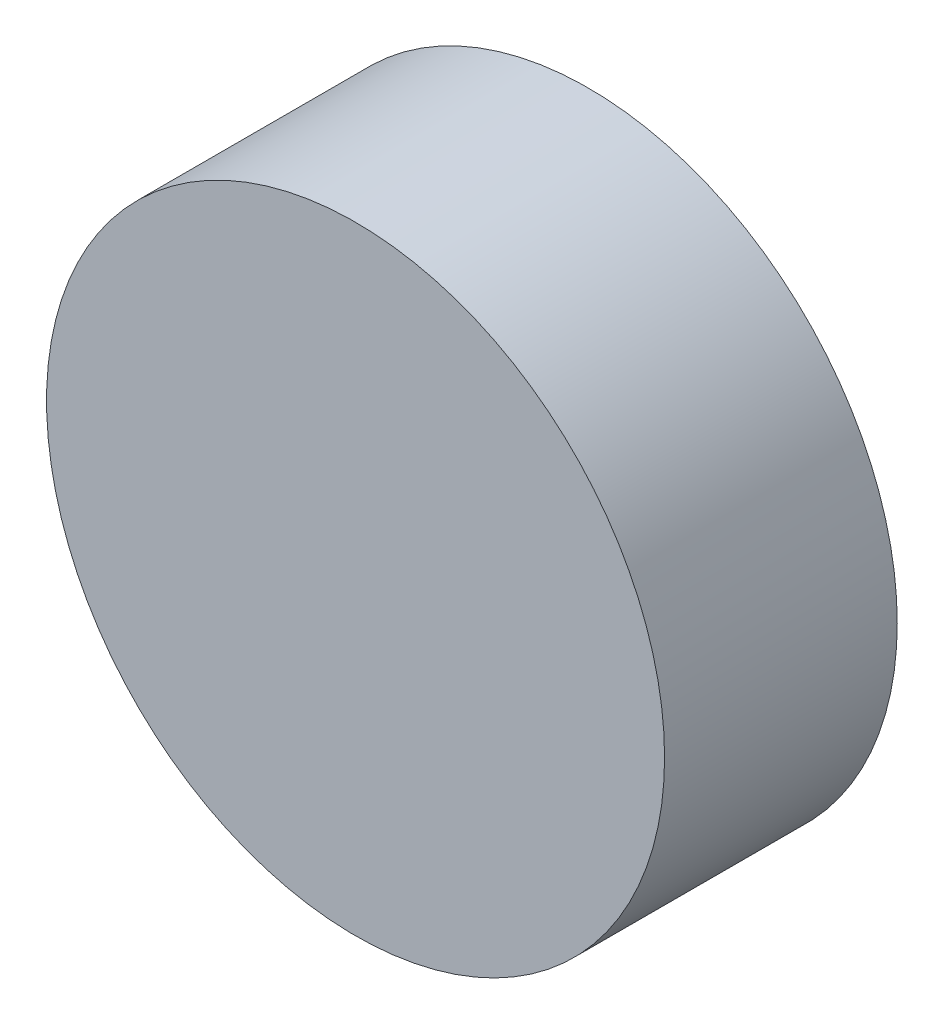
ISO-10303-21;
HEADER;
FILE_DESCRIPTION(('STEP AP214'),'2;1');
FILE_NAME('part.step','',(''),(''),'','','');
FILE_SCHEMA(('AUTOMOTIVE_DESIGN { 1 0 10303 214 1 1 1 1 }'));
ENDSEC;
DATA;
#1=APPLICATION_CONTEXT('core data for automotive mechanical design processes');
#2=APPLICATION_PROTOCOL_DEFINITION('international standard','automotive_design',2000,#1);
#3=PRODUCT_CONTEXT('',#1,'mechanical');
#4=PRODUCT('Part','Part','',(#3));
#5=PRODUCT_RELATED_PRODUCT_CATEGORY('part','',(#4));
#6=PRODUCT_DEFINITION_FORMATION('','',#4);
#7=PRODUCT_DEFINITION_CONTEXT('part definition',#1,'design');
#8=PRODUCT_DEFINITION('design','',#6,#7);
#9=PRODUCT_DEFINITION_SHAPE('','',#8);
#10=(LENGTH_UNIT() NAMED_UNIT(*) SI_UNIT(.MILLI.,.METRE.));
#11=(NAMED_UNIT(*) PLANE_ANGLE_UNIT() SI_UNIT($,.RADIAN.));
#12=(NAMED_UNIT(*) SI_UNIT($,.STERADIAN.) SOLID_ANGLE_UNIT());
#13=UNCERTAINTY_MEASURE_WITH_UNIT(LENGTH_MEASURE(1.E-05),#10,'distance_accuracy_value','');
#14=(GEOMETRIC_REPRESENTATION_CONTEXT(3) GLOBAL_UNCERTAINTY_ASSIGNED_CONTEXT((#13)) GLOBAL_UNIT_ASSIGNED_CONTEXT((#10,
#11,#12)) REPRESENTATION_CONTEXT('',''));
#15=CARTESIAN_POINT('',(0.,0.,0.));
#16=DIRECTION('',(0.,0.,1.));
#17=DIRECTION('',(1.,0.,0.));
#18=AXIS2_PLACEMENT_3D('',#15,#16,#17);
#19=CARTESIAN_POINT('',(0.,0.,32.));
#20=DIRECTION('',(0.,0.,-1.));
#21=DIRECTION('',(-1.,0.,0.));
#22=AXIS2_PLACEMENT_3D('',#19,#20,#21);
#23=CYLINDRICAL_SURFACE('',#22,42.5);
#24=CARTESIAN_POINT('',(0.,0.,32.));
#25=DIRECTION('',(0.,0.,1.));
#26=DIRECTION('',(1.,0.,0.));
#27=AXIS2_PLACEMENT_3D('',#24,#25,#26);
#28=CIRCLE('',#27,42.5);
#29=CARTESIAN_POINT('',(42.5,0.,32.));
#30=VERTEX_POINT('',#29);
#31=EDGE_CURVE('E10',#30,#30,#28,.T.);
#32=ORIENTED_EDGE('',*,*,#31,.F.);
#33=EDGE_LOOP('',(#32));
#34=FACE_BOUND('',#33,.T.);
#35=CARTESIAN_POINT('',(0.,0.,0.));
#36=DIRECTION('',(0.,0.,1.));
#37=DIRECTION('',(1.,0.,0.));
#38=AXIS2_PLACEMENT_3D('',#35,#36,#37);
#39=CIRCLE('',#38,42.5);
#40=CARTESIAN_POINT('',(42.5,0.,0.));
#41=VERTEX_POINT('',#40);
#42=EDGE_CURVE('E39',#41,#41,#39,.T.);
#43=ORIENTED_EDGE('',*,*,#42,.T.);
#44=EDGE_LOOP('',(#43));
#45=FACE_BOUND('',#44,.T.);
#46=ADVANCED_FACE('F36',(#34,#45),#23,.T.);
#47=CARTESIAN_POINT('',(0.,0.,32.));
#48=DIRECTION('',(0.,0.,1.));
#49=DIRECTION('',(1.,0.,0.));
#50=AXIS2_PLACEMENT_3D('',#47,#48,#49);
#51=PLANE('',#50);
#52=ORIENTED_EDGE('',*,*,#31,.T.);
#53=EDGE_LOOP('',(#52));
#54=FACE_BOUND('',#53,.T.);
#55=ADVANCED_FACE('F66',(#54),#51,.T.);
#56=CARTESIAN_POINT('',(0.,0.,0.));
#57=DIRECTION('',(0.,0.,1.));
#58=DIRECTION('',(1.,0.,0.));
#59=AXIS2_PLACEMENT_3D('',#56,#57,#58);
#60=PLANE('',#59);
#61=CARTESIAN_POINT('',(0.,0.,0.));
#62=DIRECTION('',(0.,0.,1.));
#63=DIRECTION('',(1.,0.,0.));
#64=AXIS2_PLACEMENT_3D('',#61,#62,#63);
#65=CIRCLE('',#64,5.4);
#66=CARTESIAN_POINT('',(5.4,0.,0.));
#67=VERTEX_POINT('',#66);
#68=EDGE_CURVE('E48',#67,#67,#65,.T.);
#69=ORIENTED_EDGE('',*,*,#68,.T.);
#70=EDGE_LOOP('',(#69));
#71=FACE_BOUND('',#70,.T.);
#72=ORIENTED_EDGE('',*,*,#42,.F.);
#73=EDGE_LOOP('',(#72));
#74=FACE_BOUND('',#73,.T.);
#75=ADVANCED_FACE('F63',(#71,#74),#60,.F.);
#76=CARTESIAN_POINT('',(0.,0.,-10.));
#77=DIRECTION('',(0.,0.,1.));
#78=DIRECTION('',(1.,0.,0.));
#79=AXIS2_PLACEMENT_3D('',#76,#77,#78);
#80=CYLINDRICAL_SURFACE('',#79,5.4);
#81=CARTESIAN_POINT('',(0.,0.,-10.));
#82=DIRECTION('',(0.,0.,1.));
#83=DIRECTION('',(1.,0.,0.));
#84=AXIS2_PLACEMENT_3D('',#81,#82,#83);
#85=CIRCLE('',#84,5.4);
#86=CARTESIAN_POINT('',(5.4,0.,-10.));
#87=VERTEX_POINT('',#86);
#88=EDGE_CURVE('E46',#87,#87,#85,.T.);
#89=ORIENTED_EDGE('',*,*,#88,.T.);
#90=EDGE_LOOP('',(#89));
#91=FACE_BOUND('',#90,.T.);
#92=ORIENTED_EDGE('',*,*,#68,.F.);
#93=EDGE_LOOP('',(#92));
#94=FACE_BOUND('',#93,.T.);
#95=ADVANCED_FACE('F54',(#91,#94),#80,.T.);
#96=CARTESIAN_POINT('',(0.,0.,-10.));
#97=DIRECTION('',(0.,0.,1.));
#98=DIRECTION('',(1.,0.,0.));
#99=AXIS2_PLACEMENT_3D('',#96,#97,#98);
#100=PLANE('',#99);
#101=ORIENTED_EDGE('',*,*,#88,.F.);
#102=EDGE_LOOP('',(#101));
#103=FACE_BOUND('',#102,.T.);
#104=ADVANCED_FACE('F57',(#103),#100,.F.);
#105=CLOSED_SHELL('',(#46,#55,#75,#95,#104));
#106=MANIFOLD_SOLID_BREP('B2',#105);
#107=ADVANCED_BREP_SHAPE_REPRESENTATION('',(#18,#106),#14);
#108=SHAPE_DEFINITION_REPRESENTATION(#9,#107);
ENDSEC;
END-ISO-10303-21;
